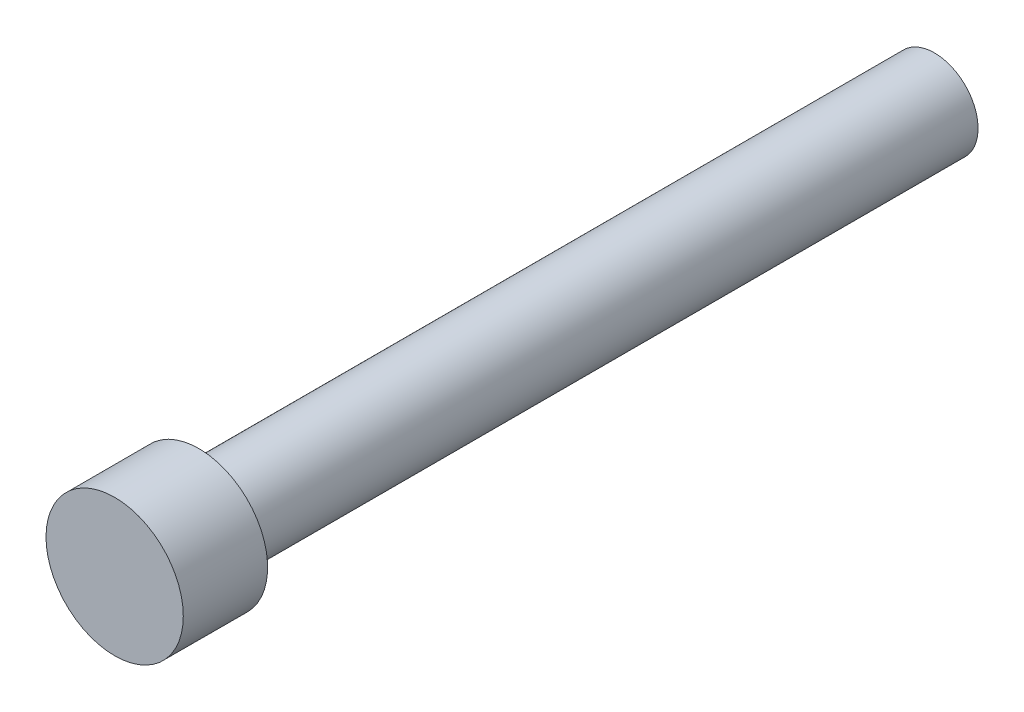
ISO-10303-21;
HEADER;
FILE_DESCRIPTION(('STEP AP214'),'2;1');
FILE_NAME('part.step','',(''),(''),'','','');
FILE_SCHEMA(('AUTOMOTIVE_DESIGN { 1 0 10303 214 1 1 1 1 }'));
ENDSEC;
DATA;
#1=APPLICATION_CONTEXT('core data for automotive mechanical design processes');
#2=APPLICATION_PROTOCOL_DEFINITION('international standard','automotive_design',2000,#1);
#3=PRODUCT_CONTEXT('',#1,'mechanical');
#4=PRODUCT('Part','Part','',(#3));
#5=PRODUCT_RELATED_PRODUCT_CATEGORY('part','',(#4));
#6=PRODUCT_DEFINITION_FORMATION('','',#4);
#7=PRODUCT_DEFINITION_CONTEXT('part definition',#1,'design');
#8=PRODUCT_DEFINITION('design','',#6,#7);
#9=PRODUCT_DEFINITION_SHAPE('','',#8);
#10=(LENGTH_UNIT() NAMED_UNIT(*) SI_UNIT(.MILLI.,.METRE.));
#11=(NAMED_UNIT(*) PLANE_ANGLE_UNIT() SI_UNIT($,.RADIAN.));
#12=(NAMED_UNIT(*) SI_UNIT($,.STERADIAN.) SOLID_ANGLE_UNIT());
#13=UNCERTAINTY_MEASURE_WITH_UNIT(LENGTH_MEASURE(1.E-05),#10,'distance_accuracy_value','');
#14=(GEOMETRIC_REPRESENTATION_CONTEXT(3) GLOBAL_UNCERTAINTY_ASSIGNED_CONTEXT((#13)) GLOBAL_UNIT_ASSIGNED_CONTEXT((#10,
#11,#12)) REPRESENTATION_CONTEXT('',''));
#15=CARTESIAN_POINT('',(0.,0.,0.));
#16=DIRECTION('',(0.,0.,1.));
#17=DIRECTION('',(1.,0.,0.));
#18=AXIS2_PLACEMENT_3D('',#15,#16,#17);
#19=CARTESIAN_POINT('',(0.,0.,21.2344));
#20=DIRECTION('',(0.,0.,-1.));
#21=DIRECTION('',(-1.,0.,0.));
#22=AXIS2_PLACEMENT_3D('',#19,#20,#21);
#23=CYLINDRICAL_SURFACE('',#22,1.778);
#24=CARTESIAN_POINT('',(0.,0.,21.2344));
#25=DIRECTION('',(0.,0.,1.));
#26=DIRECTION('',(1.,0.,0.));
#27=AXIS2_PLACEMENT_3D('',#24,#25,#26);
#28=CIRCLE('',#27,1.778);
#29=CARTESIAN_POINT('',(1.778,0.,21.2344));
#30=VERTEX_POINT('',#29);
#31=EDGE_CURVE('E11',#30,#30,#28,.T.);
#32=ORIENTED_EDGE('',*,*,#31,.F.);
#33=EDGE_LOOP('',(#32));
#34=FACE_BOUND('',#33,.T.);
#35=CARTESIAN_POINT('',(0.,0.,19.05));
#36=DIRECTION('',(0.,0.,-1.));
#37=DIRECTION('',(-1.,0.,0.));
#38=AXIS2_PLACEMENT_3D('',#35,#36,#37);
#39=CIRCLE('',#38,1.778);
#40=CARTESIAN_POINT('',(-1.778,0.,19.05));
#41=VERTEX_POINT('',#40);
#42=EDGE_CURVE('E33',#41,#41,#39,.T.);
#43=ORIENTED_EDGE('',*,*,#42,.F.);
#44=EDGE_LOOP('',(#43));
#45=FACE_BOUND('',#44,.T.);
#46=ADVANCED_FACE('F30',(#34,#45),#23,.T.);
#47=CARTESIAN_POINT('',(0.,0.,21.2344));
#48=DIRECTION('',(0.,0.,1.));
#49=DIRECTION('',(1.,0.,0.));
#50=AXIS2_PLACEMENT_3D('',#47,#48,#49);
#51=PLANE('',#50);
#52=ORIENTED_EDGE('',*,*,#31,.T.);
#53=EDGE_LOOP('',(#52));
#54=FACE_BOUND('',#53,.T.);
#55=ADVANCED_FACE('F54',(#54),#51,.T.);
#56=CARTESIAN_POINT('',(0.,0.,19.05));
#57=DIRECTION('',(0.,0.,-1.));
#58=DIRECTION('',(-1.,0.,0.));
#59=AXIS2_PLACEMENT_3D('',#56,#57,#58);
#60=PLANE('',#59);
#61=CARTESIAN_POINT('',(0.,0.,19.05));
#62=DIRECTION('',(0.,0.,-1.));
#63=DIRECTION('',(-1.,0.,0.));
#64=AXIS2_PLACEMENT_3D('',#61,#62,#63);
#65=CIRCLE('',#64,1.1303);
#66=CARTESIAN_POINT('',(-1.1303,0.,19.05));
#67=VERTEX_POINT('',#66);
#68=EDGE_CURVE('E40',#67,#67,#65,.T.);
#69=ORIENTED_EDGE('',*,*,#68,.F.);
#70=EDGE_LOOP('',(#69));
#71=FACE_BOUND('',#70,.T.);
#72=ORIENTED_EDGE('',*,*,#42,.T.);
#73=EDGE_LOOP('',(#72));
#74=FACE_BOUND('',#73,.T.);
#75=ADVANCED_FACE('F51',(#71,#74),#60,.T.);
#76=CARTESIAN_POINT('',(0.,0.,19.05));
#77=DIRECTION('',(0.,0.,-1.));
#78=DIRECTION('',(-1.,0.,0.));
#79=AXIS2_PLACEMENT_3D('',#76,#77,#78);
#80=CYLINDRICAL_SURFACE('',#79,1.1303);
#81=ORIENTED_EDGE('',*,*,#68,.T.);
#82=EDGE_LOOP('',(#81));
#83=FACE_BOUND('',#82,.T.);
#84=CARTESIAN_POINT('',(0.,0.,0.));
#85=DIRECTION('',(0.,0.,-1.));
#86=DIRECTION('',(-1.,0.,0.));
#87=AXIS2_PLACEMENT_3D('',#84,#85,#86);
#88=CIRCLE('',#87,1.1303);
#89=CARTESIAN_POINT('',(-1.1303,0.,0.));
#90=VERTEX_POINT('',#89);
#91=EDGE_CURVE('E42',#90,#90,#88,.T.);
#92=ORIENTED_EDGE('',*,*,#91,.F.);
#93=EDGE_LOOP('',(#92));
#94=FACE_BOUND('',#93,.T.);
#95=ADVANCED_FACE('F48',(#83,#94),#80,.T.);
#96=CARTESIAN_POINT('',(0.,0.,0.));
#97=DIRECTION('',(0.,0.,1.));
#98=DIRECTION('',(1.,0.,0.));
#99=AXIS2_PLACEMENT_3D('',#96,#97,#98);
#100=PLANE('',#99);
#101=ORIENTED_EDGE('',*,*,#91,.T.);
#102=EDGE_LOOP('',(#101));
#103=FACE_BOUND('',#102,.T.);
#104=ADVANCED_FACE('F67',(#103),#100,.F.);
#105=CLOSED_SHELL('',(#46,#55,#75,#95,#104));
#106=MANIFOLD_SOLID_BREP('B2',#105);
#107=ADVANCED_BREP_SHAPE_REPRESENTATION('',(#18,#106),#14);
#108=SHAPE_DEFINITION_REPRESENTATION(#9,#107);
ENDSEC;
END-ISO-10303-21;
